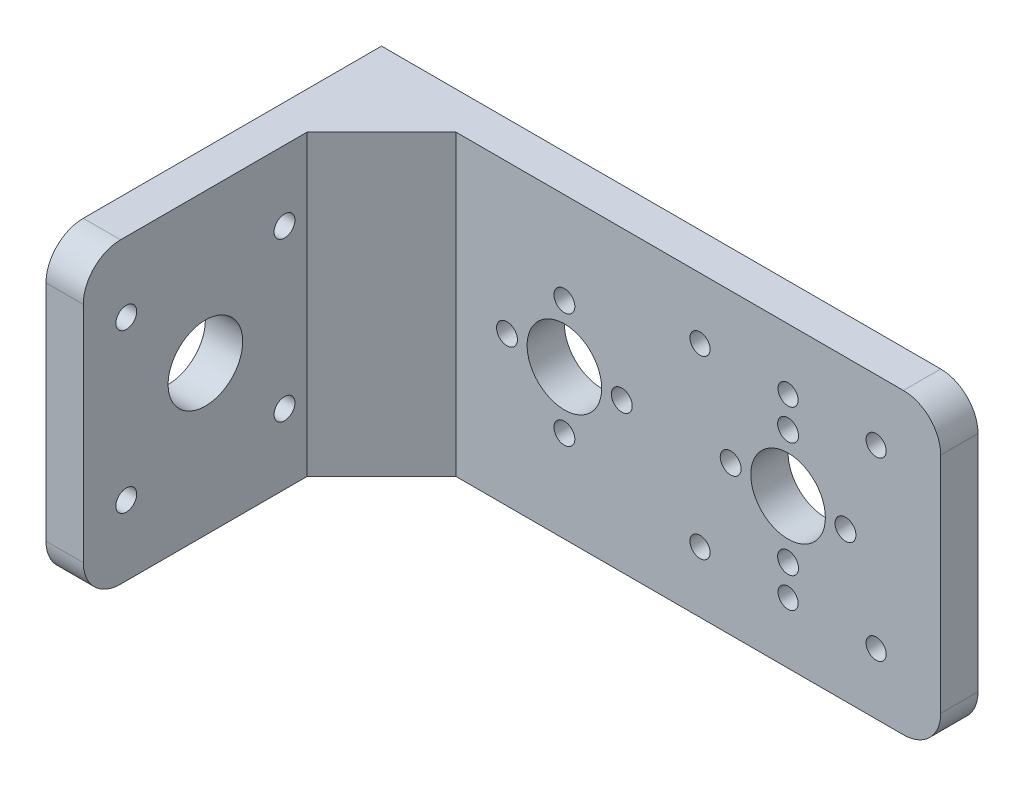
ISO-10303-21;
HEADER;
FILE_DESCRIPTION(('STEP AP214'),'2;1');
FILE_NAME('part.step','',(''),(''),'','','');
FILE_SCHEMA(('AUTOMOTIVE_DESIGN { 1 0 10303 214 1 1 1 1 }'));
ENDSEC;
DATA;
#1=APPLICATION_CONTEXT('core data for automotive mechanical design processes');
#2=APPLICATION_PROTOCOL_DEFINITION('international standard','automotive_design',2000,#1);
#3=PRODUCT_CONTEXT('',#1,'mechanical');
#4=PRODUCT('Part','Part','',(#3));
#5=PRODUCT_RELATED_PRODUCT_CATEGORY('part','',(#4));
#6=PRODUCT_DEFINITION_FORMATION('','',#4);
#7=PRODUCT_DEFINITION_CONTEXT('part definition',#1,'design');
#8=PRODUCT_DEFINITION('design','',#6,#7);
#9=PRODUCT_DEFINITION_SHAPE('','',#8);
#10=(LENGTH_UNIT() NAMED_UNIT(*) SI_UNIT(.MILLI.,.METRE.));
#11=(NAMED_UNIT(*) PLANE_ANGLE_UNIT() SI_UNIT($,.RADIAN.));
#12=(NAMED_UNIT(*) SI_UNIT($,.STERADIAN.) SOLID_ANGLE_UNIT());
#13=UNCERTAINTY_MEASURE_WITH_UNIT(LENGTH_MEASURE(1.E-05),#10,'distance_accuracy_value','');
#14=(GEOMETRIC_REPRESENTATION_CONTEXT(3) GLOBAL_UNCERTAINTY_ASSIGNED_CONTEXT((#13)) GLOBAL_UNIT_ASSIGNED_CONTEXT((#10,
#11,#12)) REPRESENTATION_CONTEXT('',''));
#15=CARTESIAN_POINT('',(0.,0.,0.));
#16=DIRECTION('',(0.,0.,1.));
#17=DIRECTION('',(1.,0.,0.));
#18=AXIS2_PLACEMENT_3D('',#15,#16,#17);
#19=CARTESIAN_POINT('',(0.,0.,6.35));
#20=DIRECTION('',(0.,0.,-1.));
#21=DIRECTION('',(-1.,0.,0.));
#22=AXIS2_PLACEMENT_3D('',#19,#20,#21);
#23=PLANE('',#22);
#24=CARTESIAN_POINT('',(-64.1,-15.621,6.35));
#25=DIRECTION('',(0.,0.,1.));
#26=DIRECTION('',(1.,0.,0.));
#27=AXIS2_PLACEMENT_3D('',#24,#25,#26);
#28=CIRCLE('',#27,1.778);
#29=CARTESIAN_POINT('',(-62.322,-15.621,6.35));
#30=VERTEX_POINT('',#29);
#31=EDGE_CURVE('E304',#30,#30,#28,.T.);
#32=ORIENTED_EDGE('',*,*,#31,.F.);
#33=EDGE_LOOP('',(#32));
#34=FACE_BOUND('',#33,.T.);
#35=CARTESIAN_POINT('',(-73.879,-25.4,6.35));
#36=DIRECTION('',(0.,0.,1.));
#37=DIRECTION('',(0.,1.,0.));
#38=AXIS2_PLACEMENT_3D('',#35,#36,#37);
#39=CIRCLE('',#38,1.778);
#40=CARTESIAN_POINT('',(-73.879,-23.622,6.35));
#41=VERTEX_POINT('',#40);
#42=EDGE_CURVE('E310',#41,#41,#39,.T.);
#43=ORIENTED_EDGE('',*,*,#42,.F.);
#44=EDGE_LOOP('',(#43));
#45=FACE_BOUND('',#44,.T.);
#46=CARTESIAN_POINT('',(-64.1,-35.179,6.35));
#47=DIRECTION('',(0.,0.,1.));
#48=DIRECTION('',(-1.,0.,0.));
#49=AXIS2_PLACEMENT_3D('',#46,#47,#48);
#50=CIRCLE('',#49,1.778);
#51=CARTESIAN_POINT('',(-65.878,-35.179,6.35));
#52=VERTEX_POINT('',#51);
#53=EDGE_CURVE('E316',#52,#52,#50,.T.);
#54=ORIENTED_EDGE('',*,*,#53,.F.);
#55=EDGE_LOOP('',(#54));
#56=FACE_BOUND('',#55,.T.);
#57=CARTESIAN_POINT('',(-54.321,-25.3999999999999,6.35));
#58=DIRECTION('',(0.,0.,1.));
#59=DIRECTION('',(0.,-1.,0.));
#60=AXIS2_PLACEMENT_3D('',#57,#58,#59);
#61=CIRCLE('',#60,1.778);
#62=CARTESIAN_POINT('',(-54.321,-27.1779999999999,6.35));
#63=VERTEX_POINT('',#62);
#64=EDGE_CURVE('E298',#63,#63,#61,.T.);
#65=ORIENTED_EDGE('',*,*,#64,.F.);
#66=EDGE_LOOP('',(#65));
#67=FACE_BOUND('',#66,.T.);
#68=CARTESIAN_POINT('',(-64.1,-25.4,6.35));
#69=DIRECTION('',(0.,0.,1.));
#70=DIRECTION('',(1.,0.,0.));
#71=AXIS2_PLACEMENT_3D('',#68,#69,#70);
#72=CIRCLE('',#71,6.35);
#73=CARTESIAN_POINT('',(-57.75,-25.4,6.35));
#74=VERTEX_POINT('',#73);
#75=EDGE_CURVE('E303',#74,#74,#72,.T.);
#76=ORIENTED_EDGE('',*,*,#75,.F.);
#77=EDGE_LOOP('',(#76));
#78=FACE_BOUND('',#77,.T.);
#79=CARTESIAN_POINT('',(-11.,-10.400000028,6.35));
#80=DIRECTION('',(0.,0.,1.));
#81=DIRECTION('',(1.,0.,0.));
#82=AXIS2_PLACEMENT_3D('',#79,#80,#81);
#83=CIRCLE('',#82,1.7145);
#84=CARTESIAN_POINT('',(-9.2855,-10.400000028,6.35));
#85=VERTEX_POINT('',#84);
#86=EDGE_CURVE('E246',#85,#85,#83,.T.);
#87=ORIENTED_EDGE('',*,*,#86,.F.);
#88=EDGE_LOOP('',(#87));
#89=FACE_BOUND('',#88,.T.);
#90=CARTESIAN_POINT('',(-25.999999972,-10.400000028,6.35));
#91=DIRECTION('',(0.,0.,1.));
#92=DIRECTION('',(1.,0.,0.));
#93=AXIS2_PLACEMENT_3D('',#90,#91,#92);
#94=CIRCLE('',#93,1.7145);
#95=CARTESIAN_POINT('',(-24.285499972,-10.400000028,6.35));
#96=VERTEX_POINT('',#95);
#97=EDGE_CURVE('E234',#96,#96,#94,.T.);
#98=ORIENTED_EDGE('',*,*,#97,.F.);
#99=EDGE_LOOP('',(#98));
#100=FACE_BOUND('',#99,.T.);
#101=CARTESIAN_POINT('',(-25.999999972,-40.399999972,6.35));
#102=DIRECTION('',(0.,0.,1.));
#103=DIRECTION('',(1.,0.,0.));
#104=AXIS2_PLACEMENT_3D('',#101,#102,#103);
#105=CIRCLE('',#104,1.7145);
#106=CARTESIAN_POINT('',(-24.285499972,-40.399999972,6.35));
#107=VERTEX_POINT('',#106);
#108=EDGE_CURVE('E240',#107,#107,#105,.T.);
#109=ORIENTED_EDGE('',*,*,#108,.F.);
#110=EDGE_LOOP('',(#109));
#111=FACE_BOUND('',#110,.T.);
#112=CARTESIAN_POINT('',(-11.,-40.399999972,6.35));
#113=DIRECTION('',(0.,0.,1.));
#114=DIRECTION('',(1.,0.,0.));
#115=AXIS2_PLACEMENT_3D('',#112,#113,#114);
#116=CIRCLE('',#115,1.7145);
#117=CARTESIAN_POINT('',(-9.2855,-40.399999972,6.35));
#118=VERTEX_POINT('',#117);
#119=EDGE_CURVE('E259',#118,#118,#116,.T.);
#120=ORIENTED_EDGE('',*,*,#119,.F.);
#121=EDGE_LOOP('',(#120));
#122=FACE_BOUND('',#121,.T.);
#123=CARTESIAN_POINT('',(-41.,-40.399999972,6.35));
#124=DIRECTION('',(0.,0.,1.));
#125=DIRECTION('',(1.,0.,0.));
#126=AXIS2_PLACEMENT_3D('',#123,#124,#125);
#127=CIRCLE('',#126,1.7145);
#128=CARTESIAN_POINT('',(-39.2855,-40.399999972,6.35));
#129=VERTEX_POINT('',#128);
#130=EDGE_CURVE('E253',#129,#129,#127,.T.);
#131=ORIENTED_EDGE('',*,*,#130,.F.);
#132=EDGE_LOOP('',(#131));
#133=FACE_BOUND('',#132,.T.);
#134=CARTESIAN_POINT('',(-41.,-10.400000028,6.35));
#135=DIRECTION('',(0.,0.,1.));
#136=DIRECTION('',(1.,0.,0.));
#137=AXIS2_PLACEMENT_3D('',#134,#135,#136);
#138=CIRCLE('',#137,1.7145);
#139=CARTESIAN_POINT('',(-39.2855,-10.400000028,6.35));
#140=VERTEX_POINT('',#139);
#141=EDGE_CURVE('E247',#140,#140,#138,.T.);
#142=ORIENTED_EDGE('',*,*,#141,.F.);
#143=EDGE_LOOP('',(#142));
#144=FACE_BOUND('',#143,.T.);
#145=CARTESIAN_POINT('',(-26.,-15.621,6.35));
#146=DIRECTION('',(0.,0.,1.));
#147=DIRECTION('',(1.,0.,0.));
#148=AXIS2_PLACEMENT_3D('',#145,#146,#147);
#149=CIRCLE('',#148,1.778);
#150=CARTESIAN_POINT('',(-24.222,-15.621,6.35));
#151=VERTEX_POINT('',#150);
#152=EDGE_CURVE('E228',#151,#151,#149,.T.);
#153=ORIENTED_EDGE('',*,*,#152,.F.);
#154=EDGE_LOOP('',(#153));
#155=FACE_BOUND('',#154,.T.);
#156=CARTESIAN_POINT('',(-26.,-25.4,6.35));
#157=DIRECTION('',(0.,0.,1.));
#158=DIRECTION('',(1.,0.,0.));
#159=AXIS2_PLACEMENT_3D('',#156,#157,#158);
#160=CIRCLE('',#159,6.35);
#161=CARTESIAN_POINT('',(-19.65,-25.4,6.35));
#162=VERTEX_POINT('',#161);
#163=EDGE_CURVE('E210',#162,#162,#160,.T.);
#164=ORIENTED_EDGE('',*,*,#163,.F.);
#165=EDGE_LOOP('',(#164));
#166=FACE_BOUND('',#165,.T.);
#167=CARTESIAN_POINT('',(-16.221,-25.3999999999999,6.35));
#168=DIRECTION('',(0.,0.,1.));
#169=DIRECTION('',(0.,-1.,0.));
#170=AXIS2_PLACEMENT_3D('',#167,#168,#169);
#171=CIRCLE('',#170,1.778);
#172=CARTESIAN_POINT('',(-16.221,-27.1779999999999,6.35));
#173=VERTEX_POINT('',#172);
#174=EDGE_CURVE('E189',#173,#173,#171,.T.);
#175=ORIENTED_EDGE('',*,*,#174,.F.);
#176=EDGE_LOOP('',(#175));
#177=FACE_BOUND('',#176,.T.);
#178=CARTESIAN_POINT('',(-26.,-35.179,6.35));
#179=DIRECTION('',(0.,0.,1.));
#180=DIRECTION('',(-1.,0.,0.));
#181=AXIS2_PLACEMENT_3D('',#178,#179,#180);
#182=CIRCLE('',#181,1.778);
#183=CARTESIAN_POINT('',(-27.778,-35.179,6.35));
#184=VERTEX_POINT('',#183);
#185=EDGE_CURVE('E217',#184,#184,#182,.T.);
#186=ORIENTED_EDGE('',*,*,#185,.F.);
#187=EDGE_LOOP('',(#186));
#188=FACE_BOUND('',#187,.T.);
#189=CARTESIAN_POINT('',(-35.779,-25.4,6.35));
#190=DIRECTION('',(0.,0.,1.));
#191=DIRECTION('',(0.,1.,0.));
#192=AXIS2_PLACEMENT_3D('',#189,#190,#191);
#193=CIRCLE('',#192,1.778);
#194=CARTESIAN_POINT('',(-35.779,-23.622,6.35));
#195=VERTEX_POINT('',#194);
#196=EDGE_CURVE('E211',#195,#195,#193,.T.);
#197=ORIENTED_EDGE('',*,*,#196,.F.);
#198=EDGE_LOOP('',(#197));
#199=FACE_BOUND('',#198,.T.);
#200=DIRECTION('',(1.,0.,0.));
#201=VECTOR('',#200,1.);
#202=CARTESIAN_POINT('',(0.,-50.8,6.35));
#203=LINE('',#202,#201);
#204=CARTESIAN_POINT('',(-82.55,-50.8,6.35));
#205=VERTEX_POINT('',#204);
#206=CARTESIAN_POINT('',(-6.35,-50.8,6.35));
#207=VERTEX_POINT('',#206);
#208=EDGE_CURVE('E149',#205,#207,#203,.T.);
#209=ORIENTED_EDGE('',*,*,#208,.T.);
#210=CARTESIAN_POINT('',(-6.35,-44.45,6.35));
#211=DIRECTION('',(0.,0.,-1.));
#212=DIRECTION('',(-1.,0.,0.));
#213=AXIS2_PLACEMENT_3D('',#210,#211,#212);
#214=CIRCLE('',#213,6.35);
#215=CARTESIAN_POINT('',(0.,-44.45,6.35));
#216=VERTEX_POINT('',#215);
#217=EDGE_CURVE('E165',#207,#216,#214,.F.);
#218=ORIENTED_EDGE('',*,*,#217,.T.);
#219=DIRECTION('',(0.,1.,0.));
#220=VECTOR('',#219,1.);
#221=CARTESIAN_POINT('',(0.,0.,6.35));
#222=LINE('',#221,#220);
#223=CARTESIAN_POINT('',(0.,-6.35,6.35));
#224=VERTEX_POINT('',#223);
#225=EDGE_CURVE('E145',#216,#224,#222,.T.);
#226=ORIENTED_EDGE('',*,*,#225,.T.);
#227=CARTESIAN_POINT('',(-6.35,-6.35,6.35));
#228=DIRECTION('',(0.,0.,-1.));
#229=DIRECTION('',(-1.,0.,0.));
#230=AXIS2_PLACEMENT_3D('',#227,#228,#229);
#231=CIRCLE('',#230,6.35);
#232=CARTESIAN_POINT('',(-6.35,0.,6.35));
#233=VERTEX_POINT('',#232);
#234=EDGE_CURVE('E163',#224,#233,#231,.F.);
#235=ORIENTED_EDGE('',*,*,#234,.T.);
#236=DIRECTION('',(-1.,0.,0.));
#237=VECTOR('',#236,1.);
#238=CARTESIAN_POINT('',(0.,0.,6.35));
#239=LINE('',#238,#237);
#240=CARTESIAN_POINT('',(-82.55,0.,6.35));
#241=VERTEX_POINT('',#240);
#242=EDGE_CURVE('E274',#233,#241,#239,.T.);
#243=ORIENTED_EDGE('',*,*,#242,.T.);
#244=DIRECTION('',(0.,-1.,0.));
#245=VECTOR('',#244,1.);
#246=CARTESIAN_POINT('',(-82.55,0.,6.35));
#247=LINE('',#246,#245);
#248=EDGE_CURVE('E292',#241,#205,#247,.T.);
#249=ORIENTED_EDGE('',*,*,#248,.T.);
#250=EDGE_LOOP('',(#209,#218,#226,#235,#243,#249));
#251=FACE_BOUND('',#250,.T.);
#252=ADVANCED_FACE('F33',(#34,#45,#56,#67,#78,#89,#100,#111,#122,#133,#144,#155,#166,#177,#188,
#199,#251),#23,.F.);
#253=CARTESIAN_POINT('',(0.,0.,6.35));
#254=DIRECTION('',(-1.,0.,0.));
#255=DIRECTION('',(0.,0.,1.));
#256=AXIS2_PLACEMENT_3D('',#253,#254,#255);
#257=PLANE('',#256);
#258=ORIENTED_EDGE('',*,*,#225,.F.);
#259=DIRECTION('',(0.,0.,-1.));
#260=VECTOR('',#259,1.);
#261=CARTESIAN_POINT('',(0.,-44.45,6.35));
#262=LINE('',#261,#260);
#263=CARTESIAN_POINT('',(0.,-44.45,0.));
#264=VERTEX_POINT('',#263);
#265=EDGE_CURVE('E152',#216,#264,#262,.T.);
#266=ORIENTED_EDGE('',*,*,#265,.T.);
#267=DIRECTION('',(0.,1.,0.));
#268=VECTOR('',#267,1.);
#269=CARTESIAN_POINT('',(0.,0.,0.));
#270=LINE('',#269,#268);
#271=CARTESIAN_POINT('',(0.,-6.35,0.));
#272=VERTEX_POINT('',#271);
#273=EDGE_CURVE('E138',#264,#272,#270,.T.);
#274=ORIENTED_EDGE('',*,*,#273,.T.);
#275=DIRECTION('',(0.,0.,-1.));
#276=VECTOR('',#275,1.);
#277=CARTESIAN_POINT('',(0.,-6.35,6.35));
#278=LINE('',#277,#276);
#279=EDGE_CURVE('E127',#272,#224,#278,.F.);
#280=ORIENTED_EDGE('',*,*,#279,.T.);
#281=EDGE_LOOP('',(#258,#266,#274,#280));
#282=FACE_BOUND('',#281,.T.);
#283=ADVANCED_FACE('F281',(#282),#257,.F.);
#284=CARTESIAN_POINT('',(0.,0.,6.35));
#285=DIRECTION('',(0.,-1.,0.));
#286=DIRECTION('',(1.,0.,0.));
#287=AXIS2_PLACEMENT_3D('',#284,#285,#286);
#288=PLANE('',#287);
#289=ORIENTED_EDGE('',*,*,#242,.F.);
#290=DIRECTION('',(0.,0.,-1.));
#291=VECTOR('',#290,1.);
#292=CARTESIAN_POINT('',(-6.35,0.,6.35));
#293=LINE('',#292,#291);
#294=CARTESIAN_POINT('',(-6.35,0.,0.));
#295=VERTEX_POINT('',#294);
#296=EDGE_CURVE('E136',#233,#295,#293,.T.);
#297=ORIENTED_EDGE('',*,*,#296,.T.);
#298=DIRECTION('',(-1.,0.,0.));
#299=VECTOR('',#298,1.);
#300=CARTESIAN_POINT('',(0.,0.,0.));
#301=LINE('',#300,#299);
#302=CARTESIAN_POINT('',(-101.6,0.,0.));
#303=VERTEX_POINT('',#302);
#304=EDGE_CURVE('E132',#295,#303,#301,.T.);
#305=ORIENTED_EDGE('',*,*,#304,.T.);
#306=DIRECTION('',(0.,0.,-1.));
#307=VECTOR('',#306,1.);
#308=CARTESIAN_POINT('',(-101.6,0.,6.35));
#309=LINE('',#308,#307);
#310=CARTESIAN_POINT('',(-101.6,0.,50.8));
#311=VERTEX_POINT('',#310);
#312=EDGE_CURVE('E116',#311,#303,#309,.T.);
#313=ORIENTED_EDGE('',*,*,#312,.F.);
#314=DIRECTION('',(-1.,0.,0.));
#315=VECTOR('',#314,1.);
#316=CARTESIAN_POINT('',(-95.25,0.,50.8));
#317=LINE('',#316,#315);
#318=CARTESIAN_POINT('',(-95.25,0.,50.8));
#319=VERTEX_POINT('',#318);
#320=EDGE_CURVE('E167',#311,#319,#317,.F.);
#321=ORIENTED_EDGE('',*,*,#320,.T.);
#322=DIRECTION('',(0.,0.,-1.));
#323=VECTOR('',#322,1.);
#324=CARTESIAN_POINT('',(-95.25,0.,57.15));
#325=LINE('',#324,#323);
#326=CARTESIAN_POINT('',(-95.25,0.,19.05));
#327=VERTEX_POINT('',#326);
#328=EDGE_CURVE('E190',#319,#327,#325,.T.);
#329=ORIENTED_EDGE('',*,*,#328,.T.);
#330=DIRECTION('',(-0.707106781186547,0.,0.707106781186548));
#331=VECTOR('',#330,1.);
#332=CARTESIAN_POINT('',(-95.25,0.,19.05));
#333=LINE('',#332,#331);
#334=EDGE_CURVE('E290',#241,#327,#333,.T.);
#335=ORIENTED_EDGE('',*,*,#334,.F.);
#336=EDGE_LOOP('',(#289,#297,#305,#313,#321,#329,#335));
#337=FACE_BOUND('',#336,.T.);
#338=ADVANCED_FACE('F134',(#337),#288,.F.);
#339=CARTESIAN_POINT('',(-101.6,0.,6.35));
#340=DIRECTION('',(1.,0.,0.));
#341=DIRECTION('',(0.,0.,-1.));
#342=AXIS2_PLACEMENT_3D('',#339,#340,#341);
#343=PLANE('',#342);
#344=CARTESIAN_POINT('',(-101.6,-38.8747000000001,49.8247));
#345=DIRECTION('',(1.,0.,0.));
#346=DIRECTION('',(0.,1.,0.));
#347=AXIS2_PLACEMENT_3D('',#344,#345,#346);
#348=CIRCLE('',#347,1.778);
#349=CARTESIAN_POINT('',(-101.6,-37.0967000000001,49.8247));
#350=VERTEX_POINT('',#349);
#351=EDGE_CURVE('E330',#350,#350,#348,.T.);
#352=ORIENTED_EDGE('',*,*,#351,.T.);
#353=EDGE_LOOP('',(#352));
#354=FACE_BOUND('',#353,.T.);
#355=CARTESIAN_POINT('',(-101.6,-38.8747,22.8753));
#356=DIRECTION('',(1.,0.,0.));
#357=DIRECTION('',(0.,0.,1.));
#358=AXIS2_PLACEMENT_3D('',#355,#356,#357);
#359=CIRCLE('',#358,1.778);
#360=CARTESIAN_POINT('',(-101.6,-38.8747,24.6533));
#361=VERTEX_POINT('',#360);
#362=EDGE_CURVE('E337',#361,#361,#359,.T.);
#363=ORIENTED_EDGE('',*,*,#362,.T.);
#364=EDGE_LOOP('',(#363));
#365=FACE_BOUND('',#364,.T.);
#366=CARTESIAN_POINT('',(-101.6,-11.9252999999999,22.8753000000001));
#367=DIRECTION('',(1.,0.,0.));
#368=DIRECTION('',(0.,-1.,0.));
#369=AXIS2_PLACEMENT_3D('',#366,#367,#368);
#370=CIRCLE('',#369,1.778);
#371=CARTESIAN_POINT('',(-101.6,-13.7032999999999,22.8753000000001));
#372=VERTEX_POINT('',#371);
#373=EDGE_CURVE('E343',#372,#372,#370,.T.);
#374=ORIENTED_EDGE('',*,*,#373,.T.);
#375=EDGE_LOOP('',(#374));
#376=FACE_BOUND('',#375,.T.);
#377=CARTESIAN_POINT('',(-101.6,-11.9253,49.8247));
#378=DIRECTION('',(1.,0.,0.));
#379=DIRECTION('',(0.,0.,-1.));
#380=AXIS2_PLACEMENT_3D('',#377,#378,#379);
#381=CIRCLE('',#380,1.778);
#382=CARTESIAN_POINT('',(-101.6,-11.9253,48.0467));
#383=VERTEX_POINT('',#382);
#384=EDGE_CURVE('E348',#383,#383,#381,.T.);
#385=ORIENTED_EDGE('',*,*,#384,.T.);
#386=EDGE_LOOP('',(#385));
#387=FACE_BOUND('',#386,.T.);
#388=CARTESIAN_POINT('',(-101.6,-25.4,36.35));
#389=DIRECTION('',(1.,0.,0.));
#390=DIRECTION('',(0.,0.,-1.));
#391=AXIS2_PLACEMENT_3D('',#388,#389,#390);
#392=CIRCLE('',#391,6.35);
#393=CARTESIAN_POINT('',(-101.6,-25.4,30.));
#394=VERTEX_POINT('',#393);
#395=EDGE_CURVE('E198',#394,#394,#392,.T.);
#396=ORIENTED_EDGE('',*,*,#395,.T.);
#397=EDGE_LOOP('',(#396));
#398=FACE_BOUND('',#397,.T.);
#399=DIRECTION('',(0.,-1.,0.));
#400=VECTOR('',#399,1.);
#401=CARTESIAN_POINT('',(-101.6,0.,57.15));
#402=LINE('',#401,#400);
#403=CARTESIAN_POINT('',(-101.6,-6.35000000000001,57.15));
#404=VERTEX_POINT('',#403);
#405=CARTESIAN_POINT('',(-101.6,-44.45,57.15));
#406=VERTEX_POINT('',#405);
#407=EDGE_CURVE('E194',#404,#406,#402,.T.);
#408=ORIENTED_EDGE('',*,*,#407,.F.);
#409=CARTESIAN_POINT('',(-101.6,-6.35000000000001,50.8));
#410=DIRECTION('',(1.,0.,0.));
#411=DIRECTION('',(0.,0.,-1.));
#412=AXIS2_PLACEMENT_3D('',#409,#410,#411);
#413=CIRCLE('',#412,6.35);
#414=EDGE_CURVE('E124',#404,#311,#413,.F.);
#415=ORIENTED_EDGE('',*,*,#414,.T.);
#416=ORIENTED_EDGE('',*,*,#312,.T.);
#417=DIRECTION('',(0.,-1.,0.));
#418=VECTOR('',#417,1.);
#419=CARTESIAN_POINT('',(-101.6,0.,0.));
#420=LINE('',#419,#418);
#421=CARTESIAN_POINT('',(-101.6,-50.8,0.));
#422=VERTEX_POINT('',#421);
#423=EDGE_CURVE('E122',#303,#422,#420,.T.);
#424=ORIENTED_EDGE('',*,*,#423,.T.);
#425=DIRECTION('',(0.,0.,-1.));
#426=VECTOR('',#425,1.);
#427=CARTESIAN_POINT('',(-101.6,-50.8,6.35));
#428=LINE('',#427,#426);
#429=CARTESIAN_POINT('',(-101.6,-50.8,50.8));
#430=VERTEX_POINT('',#429);
#431=EDGE_CURVE('E128',#430,#422,#428,.T.);
#432=ORIENTED_EDGE('',*,*,#431,.F.);
#433=CARTESIAN_POINT('',(-101.6,-44.45,50.8));
#434=DIRECTION('',(1.,0.,0.));
#435=DIRECTION('',(0.,0.,-1.));
#436=AXIS2_PLACEMENT_3D('',#433,#434,#435);
#437=CIRCLE('',#436,6.35);
#438=EDGE_CURVE('E175',#430,#406,#437,.F.);
#439=ORIENTED_EDGE('',*,*,#438,.T.);
#440=EDGE_LOOP('',(#408,#415,#416,#424,#432,#439));
#441=FACE_BOUND('',#440,.T.);
#442=ADVANCED_FACE('F119',(#354,#365,#376,#387,#398,#441),#343,.F.);
#443=CARTESIAN_POINT('',(0.,-50.8,6.35));
#444=DIRECTION('',(0.,1.,0.));
#445=DIRECTION('',(-1.,0.,0.));
#446=AXIS2_PLACEMENT_3D('',#443,#444,#445);
#447=PLANE('',#446);
#448=DIRECTION('',(1.,0.,0.));
#449=VECTOR('',#448,1.);
#450=CARTESIAN_POINT('',(0.,-50.8,0.));
#451=LINE('',#450,#449);
#452=CARTESIAN_POINT('',(-6.35,-50.8,0.));
#453=VERTEX_POINT('',#452);
#454=EDGE_CURVE('E143',#422,#453,#451,.T.);
#455=ORIENTED_EDGE('',*,*,#454,.T.);
#456=DIRECTION('',(0.,0.,-1.));
#457=VECTOR('',#456,1.);
#458=CARTESIAN_POINT('',(-6.35,-50.8,6.35));
#459=LINE('',#458,#457);
#460=EDGE_CURVE('E161',#453,#207,#459,.F.);
#461=ORIENTED_EDGE('',*,*,#460,.T.);
#462=ORIENTED_EDGE('',*,*,#208,.F.);
#463=DIRECTION('',(-0.707106781186547,0.,0.707106781186548));
#464=VECTOR('',#463,1.);
#465=CARTESIAN_POINT('',(-95.25,-50.8,19.05));
#466=LINE('',#465,#464);
#467=CARTESIAN_POINT('',(-95.25,-50.8,19.05));
#468=VERTEX_POINT('',#467);
#469=EDGE_CURVE('E188',#205,#468,#466,.T.);
#470=ORIENTED_EDGE('',*,*,#469,.T.);
#471=DIRECTION('',(0.,0.,-1.));
#472=VECTOR('',#471,1.);
#473=CARTESIAN_POINT('',(-95.25,-50.8,57.15));
#474=LINE('',#473,#472);
#475=CARTESIAN_POINT('',(-95.25,-50.8,50.8));
#476=VERTEX_POINT('',#475);
#477=EDGE_CURVE('E180',#476,#468,#474,.T.);
#478=ORIENTED_EDGE('',*,*,#477,.F.);
#479=DIRECTION('',(1.,0.,0.));
#480=VECTOR('',#479,1.);
#481=CARTESIAN_POINT('',(-101.6,-50.8,50.8));
#482=LINE('',#481,#480);
#483=EDGE_CURVE('E159',#476,#430,#482,.F.);
#484=ORIENTED_EDGE('',*,*,#483,.T.);
#485=ORIENTED_EDGE('',*,*,#431,.T.);
#486=EDGE_LOOP('',(#455,#461,#462,#470,#478,#484,#485));
#487=FACE_BOUND('',#486,.T.);
#488=ADVANCED_FACE('F185',(#487),#447,.F.);
#489=CARTESIAN_POINT('',(0.,0.,0.));
#490=DIRECTION('',(0.,0.,-1.));
#491=DIRECTION('',(-1.,0.,0.));
#492=AXIS2_PLACEMENT_3D('',#489,#490,#491);
#493=PLANE('',#492);
#494=CARTESIAN_POINT('',(-64.1,-15.621,0.));
#495=DIRECTION('',(0.,0.,1.));
#496=DIRECTION('',(1.,0.,0.));
#497=AXIS2_PLACEMENT_3D('',#494,#495,#496);
#498=CIRCLE('',#497,1.778);
#499=CARTESIAN_POINT('',(-62.322,-15.621,0.));
#500=VERTEX_POINT('',#499);
#501=EDGE_CURVE('E300',#500,#500,#498,.T.);
#502=ORIENTED_EDGE('',*,*,#501,.T.);
#503=EDGE_LOOP('',(#502));
#504=FACE_BOUND('',#503,.T.);
#505=CARTESIAN_POINT('',(-73.879,-25.4,0.));
#506=DIRECTION('',(0.,0.,1.));
#507=DIRECTION('',(0.,1.,0.));
#508=AXIS2_PLACEMENT_3D('',#505,#506,#507);
#509=CIRCLE('',#508,1.778);
#510=CARTESIAN_POINT('',(-73.879,-23.622,0.));
#511=VERTEX_POINT('',#510);
#512=EDGE_CURVE('E307',#511,#511,#509,.T.);
#513=ORIENTED_EDGE('',*,*,#512,.T.);
#514=EDGE_LOOP('',(#513));
#515=FACE_BOUND('',#514,.T.);
#516=CARTESIAN_POINT('',(-64.1,-35.179,0.));
#517=DIRECTION('',(0.,0.,1.));
#518=DIRECTION('',(-1.,0.,0.));
#519=AXIS2_PLACEMENT_3D('',#516,#517,#518);
#520=CIRCLE('',#519,1.778);
#521=CARTESIAN_POINT('',(-65.878,-35.179,0.));
#522=VERTEX_POINT('',#521);
#523=EDGE_CURVE('E313',#522,#522,#520,.T.);
#524=ORIENTED_EDGE('',*,*,#523,.T.);
#525=EDGE_LOOP('',(#524));
#526=FACE_BOUND('',#525,.T.);
#527=CARTESIAN_POINT('',(-54.321,-25.3999999999999,0.));
#528=DIRECTION('',(0.,0.,1.));
#529=DIRECTION('',(0.,-1.,0.));
#530=AXIS2_PLACEMENT_3D('',#527,#528,#529);
#531=CIRCLE('',#530,1.778);
#532=CARTESIAN_POINT('',(-54.321,-27.1779999999999,0.));
#533=VERTEX_POINT('',#532);
#534=EDGE_CURVE('E319',#533,#533,#531,.T.);
#535=ORIENTED_EDGE('',*,*,#534,.T.);
#536=EDGE_LOOP('',(#535));
#537=FACE_BOUND('',#536,.T.);
#538=CARTESIAN_POINT('',(-64.1,-25.4,0.));
#539=DIRECTION('',(0.,0.,1.));
#540=DIRECTION('',(1.,0.,0.));
#541=AXIS2_PLACEMENT_3D('',#538,#539,#540);
#542=CIRCLE('',#541,6.35);
#543=CARTESIAN_POINT('',(-57.75,-25.4,0.));
#544=VERTEX_POINT('',#543);
#545=EDGE_CURVE('E324',#544,#544,#542,.T.);
#546=ORIENTED_EDGE('',*,*,#545,.T.);
#547=EDGE_LOOP('',(#546));
#548=FACE_BOUND('',#547,.T.);
#549=CARTESIAN_POINT('',(-35.779,-25.4,0.));
#550=DIRECTION('',(0.,0.,1.));
#551=DIRECTION('',(0.,1.,0.));
#552=AXIS2_PLACEMENT_3D('',#549,#550,#551);
#553=CIRCLE('',#552,1.778);
#554=CARTESIAN_POINT('',(-35.779,-23.622,0.));
#555=VERTEX_POINT('',#554);
#556=EDGE_CURVE('E207',#555,#555,#553,.T.);
#557=ORIENTED_EDGE('',*,*,#556,.T.);
#558=EDGE_LOOP('',(#557));
#559=FACE_BOUND('',#558,.T.);
#560=CARTESIAN_POINT('',(-26.,-35.179,0.));
#561=DIRECTION('',(0.,0.,1.));
#562=DIRECTION('',(-1.,0.,0.));
#563=AXIS2_PLACEMENT_3D('',#560,#561,#562);
#564=CIRCLE('',#563,1.778);
#565=CARTESIAN_POINT('',(-27.778,-35.179,0.));
#566=VERTEX_POINT('',#565);
#567=EDGE_CURVE('E214',#566,#566,#564,.T.);
#568=ORIENTED_EDGE('',*,*,#567,.T.);
#569=EDGE_LOOP('',(#568));
#570=FACE_BOUND('',#569,.T.);
#571=CARTESIAN_POINT('',(-16.221,-25.3999999999999,0.));
#572=DIRECTION('',(0.,0.,1.));
#573=DIRECTION('',(0.,-1.,0.));
#574=AXIS2_PLACEMENT_3D('',#571,#572,#573);
#575=CIRCLE('',#574,1.778);
#576=CARTESIAN_POINT('',(-16.221,-27.1779999999999,0.));
#577=VERTEX_POINT('',#576);
#578=EDGE_CURVE('E220',#577,#577,#575,.T.);
#579=ORIENTED_EDGE('',*,*,#578,.T.);
#580=EDGE_LOOP('',(#579));
#581=FACE_BOUND('',#580,.T.);
#582=CARTESIAN_POINT('',(-26.,-25.4,0.));
#583=DIRECTION('',(0.,0.,1.));
#584=DIRECTION('',(1.,0.,0.));
#585=AXIS2_PLACEMENT_3D('',#582,#583,#584);
#586=CIRCLE('',#585,6.35);
#587=CARTESIAN_POINT('',(-19.65,-25.4,0.));
#588=VERTEX_POINT('',#587);
#589=EDGE_CURVE('E225',#588,#588,#586,.T.);
#590=ORIENTED_EDGE('',*,*,#589,.T.);
#591=EDGE_LOOP('',(#590));
#592=FACE_BOUND('',#591,.T.);
#593=CARTESIAN_POINT('',(-26.,-15.621,0.));
#594=DIRECTION('',(0.,0.,1.));
#595=DIRECTION('',(1.,0.,0.));
#596=AXIS2_PLACEMENT_3D('',#593,#594,#595);
#597=CIRCLE('',#596,1.778);
#598=CARTESIAN_POINT('',(-24.222,-15.621,0.));
#599=VERTEX_POINT('',#598);
#600=EDGE_CURVE('E231',#599,#599,#597,.T.);
#601=ORIENTED_EDGE('',*,*,#600,.T.);
#602=EDGE_LOOP('',(#601));
#603=FACE_BOUND('',#602,.T.);
#604=CARTESIAN_POINT('',(-41.,-10.400000028,0.));
#605=DIRECTION('',(0.,0.,1.));
#606=DIRECTION('',(1.,0.,0.));
#607=AXIS2_PLACEMENT_3D('',#604,#605,#606);
#608=CIRCLE('',#607,1.7145);
#609=CARTESIAN_POINT('',(-39.2855,-10.400000028,0.));
#610=VERTEX_POINT('',#609);
#611=EDGE_CURVE('E243',#610,#610,#608,.T.);
#612=ORIENTED_EDGE('',*,*,#611,.T.);
#613=EDGE_LOOP('',(#612));
#614=FACE_BOUND('',#613,.T.);
#615=CARTESIAN_POINT('',(-41.,-40.399999972,0.));
#616=DIRECTION('',(0.,0.,1.));
#617=DIRECTION('',(1.,0.,0.));
#618=AXIS2_PLACEMENT_3D('',#615,#616,#617);
#619=CIRCLE('',#618,1.7145);
#620=CARTESIAN_POINT('',(-39.2855,-40.399999972,0.));
#621=VERTEX_POINT('',#620);
#622=EDGE_CURVE('E250',#621,#621,#619,.T.);
#623=ORIENTED_EDGE('',*,*,#622,.T.);
#624=EDGE_LOOP('',(#623));
#625=FACE_BOUND('',#624,.T.);
#626=CARTESIAN_POINT('',(-11.,-40.399999972,0.));
#627=DIRECTION('',(0.,0.,1.));
#628=DIRECTION('',(1.,0.,0.));
#629=AXIS2_PLACEMENT_3D('',#626,#627,#628);
#630=CIRCLE('',#629,1.7145);
#631=CARTESIAN_POINT('',(-9.2855,-40.399999972,0.));
#632=VERTEX_POINT('',#631);
#633=EDGE_CURVE('E256',#632,#632,#630,.T.);
#634=ORIENTED_EDGE('',*,*,#633,.T.);
#635=EDGE_LOOP('',(#634));
#636=FACE_BOUND('',#635,.T.);
#637=CARTESIAN_POINT('',(-25.999999972,-40.399999972,0.));
#638=DIRECTION('',(0.,0.,1.));
#639=DIRECTION('',(1.,0.,0.));
#640=AXIS2_PLACEMENT_3D('',#637,#638,#639);
#641=CIRCLE('',#640,1.7145);
#642=CARTESIAN_POINT('',(-24.285499972,-40.399999972,0.));
#643=VERTEX_POINT('',#642);
#644=EDGE_CURVE('E262',#643,#643,#641,.T.);
#645=ORIENTED_EDGE('',*,*,#644,.T.);
#646=EDGE_LOOP('',(#645));
#647=FACE_BOUND('',#646,.T.);
#648=CARTESIAN_POINT('',(-25.999999972,-10.400000028,0.));
#649=DIRECTION('',(0.,0.,1.));
#650=DIRECTION('',(1.,0.,0.));
#651=AXIS2_PLACEMENT_3D('',#648,#649,#650);
#652=CIRCLE('',#651,1.7145);
#653=CARTESIAN_POINT('',(-24.285499972,-10.400000028,0.));
#654=VERTEX_POINT('',#653);
#655=EDGE_CURVE('E237',#654,#654,#652,.T.);
#656=ORIENTED_EDGE('',*,*,#655,.T.);
#657=EDGE_LOOP('',(#656));
#658=FACE_BOUND('',#657,.T.);
#659=CARTESIAN_POINT('',(-11.,-10.400000028,0.));
#660=DIRECTION('',(0.,0.,1.));
#661=DIRECTION('',(1.,0.,0.));
#662=AXIS2_PLACEMENT_3D('',#659,#660,#661);
#663=CIRCLE('',#662,1.7145);
#664=CARTESIAN_POINT('',(-9.2855,-10.400000028,0.));
#665=VERTEX_POINT('',#664);
#666=EDGE_CURVE('E267',#665,#665,#663,.T.);
#667=ORIENTED_EDGE('',*,*,#666,.T.);
#668=EDGE_LOOP('',(#667));
#669=FACE_BOUND('',#668,.T.);
#670=ORIENTED_EDGE('',*,*,#273,.F.);
#671=CARTESIAN_POINT('',(-6.35,-44.45,0.));
#672=DIRECTION('',(0.,0.,-1.));
#673=DIRECTION('',(-1.,0.,0.));
#674=AXIS2_PLACEMENT_3D('',#671,#672,#673);
#675=CIRCLE('',#674,6.35);
#676=EDGE_CURVE('E157',#264,#453,#675,.T.);
#677=ORIENTED_EDGE('',*,*,#676,.T.);
#678=ORIENTED_EDGE('',*,*,#454,.F.);
#679=ORIENTED_EDGE('',*,*,#423,.F.);
#680=ORIENTED_EDGE('',*,*,#304,.F.);
#681=CARTESIAN_POINT('',(-6.35,-6.35,0.));
#682=DIRECTION('',(0.,0.,-1.));
#683=DIRECTION('',(-1.,0.,0.));
#684=AXIS2_PLACEMENT_3D('',#681,#682,#683);
#685=CIRCLE('',#684,6.35);
#686=EDGE_CURVE('E155',#295,#272,#685,.T.);
#687=ORIENTED_EDGE('',*,*,#686,.T.);
#688=EDGE_LOOP('',(#670,#677,#678,#679,#680,#687));
#689=FACE_BOUND('',#688,.T.);
#690=ADVANCED_FACE('F141',(#504,#515,#526,#537,#548,#559,#570,#581,#592,#603,#614,#625,#636,
#647,#658,#669,#689),#493,.T.);
#691=CARTESIAN_POINT('',(-11.,-10.400000028,0.));
#692=DIRECTION('',(0.,0.,1.));
#693=DIRECTION('',(1.,0.,0.));
#694=AXIS2_PLACEMENT_3D('',#691,#692,#693);
#695=CYLINDRICAL_SURFACE('',#694,1.7145);
#696=ORIENTED_EDGE('',*,*,#666,.F.);
#697=EDGE_LOOP('',(#696));
#698=FACE_BOUND('',#697,.T.);
#699=ORIENTED_EDGE('',*,*,#86,.T.);
#700=EDGE_LOOP('',(#699));
#701=FACE_BOUND('',#700,.T.);
#702=ADVANCED_FACE('F388',(#698,#701),#695,.F.);
#703=CARTESIAN_POINT('',(-25.999999972,-10.400000028,0.));
#704=DIRECTION('',(0.,0.,1.));
#705=DIRECTION('',(1.,0.,0.));
#706=AXIS2_PLACEMENT_3D('',#703,#704,#705);
#707=CYLINDRICAL_SURFACE('',#706,1.7145);
#708=ORIENTED_EDGE('',*,*,#655,.F.);
#709=EDGE_LOOP('',(#708));
#710=FACE_BOUND('',#709,.T.);
#711=ORIENTED_EDGE('',*,*,#97,.T.);
#712=EDGE_LOOP('',(#711));
#713=FACE_BOUND('',#712,.T.);
#714=ADVANCED_FACE('F679',(#710,#713),#707,.F.);
#715=CARTESIAN_POINT('',(-25.999999972,-40.399999972,0.));
#716=DIRECTION('',(0.,0.,1.));
#717=DIRECTION('',(1.,0.,0.));
#718=AXIS2_PLACEMENT_3D('',#715,#716,#717);
#719=CYLINDRICAL_SURFACE('',#718,1.7145);
#720=ORIENTED_EDGE('',*,*,#644,.F.);
#721=EDGE_LOOP('',(#720));
#722=FACE_BOUND('',#721,.T.);
#723=ORIENTED_EDGE('',*,*,#108,.T.);
#724=EDGE_LOOP('',(#723));
#725=FACE_BOUND('',#724,.T.);
#726=ADVANCED_FACE('F669',(#722,#725),#719,.F.);
#727=CARTESIAN_POINT('',(-11.,-40.399999972,0.));
#728=DIRECTION('',(0.,0.,1.));
#729=DIRECTION('',(1.,0.,0.));
#730=AXIS2_PLACEMENT_3D('',#727,#728,#729);
#731=CYLINDRICAL_SURFACE('',#730,1.7145);
#732=ORIENTED_EDGE('',*,*,#633,.F.);
#733=EDGE_LOOP('',(#732));
#734=FACE_BOUND('',#733,.T.);
#735=ORIENTED_EDGE('',*,*,#119,.T.);
#736=EDGE_LOOP('',(#735));
#737=FACE_BOUND('',#736,.T.);
#738=ADVANCED_FACE('F659',(#734,#737),#731,.F.);
#739=CARTESIAN_POINT('',(-41.,-40.399999972,0.));
#740=DIRECTION('',(0.,0.,1.));
#741=DIRECTION('',(1.,0.,0.));
#742=AXIS2_PLACEMENT_3D('',#739,#740,#741);
#743=CYLINDRICAL_SURFACE('',#742,1.7145);
#744=ORIENTED_EDGE('',*,*,#622,.F.);
#745=EDGE_LOOP('',(#744));
#746=FACE_BOUND('',#745,.T.);
#747=ORIENTED_EDGE('',*,*,#130,.T.);
#748=EDGE_LOOP('',(#747));
#749=FACE_BOUND('',#748,.T.);
#750=ADVANCED_FACE('F649',(#746,#749),#743,.F.);
#751=CARTESIAN_POINT('',(-41.,-10.400000028,0.));
#752=DIRECTION('',(0.,0.,1.));
#753=DIRECTION('',(1.,0.,0.));
#754=AXIS2_PLACEMENT_3D('',#751,#752,#753);
#755=CYLINDRICAL_SURFACE('',#754,1.7145);
#756=ORIENTED_EDGE('',*,*,#611,.F.);
#757=EDGE_LOOP('',(#756));
#758=FACE_BOUND('',#757,.T.);
#759=ORIENTED_EDGE('',*,*,#141,.T.);
#760=EDGE_LOOP('',(#759));
#761=FACE_BOUND('',#760,.T.);
#762=ADVANCED_FACE('F639',(#758,#761),#755,.F.);
#763=CARTESIAN_POINT('',(-26.,-15.621,0.));
#764=DIRECTION('',(0.,0.,1.));
#765=DIRECTION('',(1.,0.,0.));
#766=AXIS2_PLACEMENT_3D('',#763,#764,#765);
#767=CYLINDRICAL_SURFACE('',#766,1.778);
#768=ORIENTED_EDGE('',*,*,#600,.F.);
#769=EDGE_LOOP('',(#768));
#770=FACE_BOUND('',#769,.T.);
#771=ORIENTED_EDGE('',*,*,#152,.T.);
#772=EDGE_LOOP('',(#771));
#773=FACE_BOUND('',#772,.T.);
#774=ADVANCED_FACE('F629',(#770,#773),#767,.F.);
#775=CARTESIAN_POINT('',(-26.,-25.4,0.));
#776=DIRECTION('',(0.,0.,1.));
#777=DIRECTION('',(1.,0.,0.));
#778=AXIS2_PLACEMENT_3D('',#775,#776,#777);
#779=CYLINDRICAL_SURFACE('',#778,6.35);
#780=ORIENTED_EDGE('',*,*,#589,.F.);
#781=EDGE_LOOP('',(#780));
#782=FACE_BOUND('',#781,.T.);
#783=ORIENTED_EDGE('',*,*,#163,.T.);
#784=EDGE_LOOP('',(#783));
#785=FACE_BOUND('',#784,.T.);
#786=ADVANCED_FACE('F619',(#782,#785),#779,.F.);
#787=CARTESIAN_POINT('',(-16.221,-25.3999999999999,0.));
#788=DIRECTION('',(0.,0.,1.));
#789=DIRECTION('',(1.,0.,0.));
#790=AXIS2_PLACEMENT_3D('',#787,#788,#789);
#791=CYLINDRICAL_SURFACE('',#790,1.778);
#792=ORIENTED_EDGE('',*,*,#578,.F.);
#793=EDGE_LOOP('',(#792));
#794=FACE_BOUND('',#793,.T.);
#795=ORIENTED_EDGE('',*,*,#174,.T.);
#796=EDGE_LOOP('',(#795));
#797=FACE_BOUND('',#796,.T.);
#798=ADVANCED_FACE('F609',(#794,#797),#791,.F.);
#799=CARTESIAN_POINT('',(-26.,-35.179,0.));
#800=DIRECTION('',(0.,0.,1.));
#801=DIRECTION('',(1.,0.,0.));
#802=AXIS2_PLACEMENT_3D('',#799,#800,#801);
#803=CYLINDRICAL_SURFACE('',#802,1.778);
#804=ORIENTED_EDGE('',*,*,#567,.F.);
#805=EDGE_LOOP('',(#804));
#806=FACE_BOUND('',#805,.T.);
#807=ORIENTED_EDGE('',*,*,#185,.T.);
#808=EDGE_LOOP('',(#807));
#809=FACE_BOUND('',#808,.T.);
#810=ADVANCED_FACE('F599',(#806,#809),#803,.F.);
#811=CARTESIAN_POINT('',(-35.779,-25.4,0.));
#812=DIRECTION('',(0.,0.,1.));
#813=DIRECTION('',(1.,0.,0.));
#814=AXIS2_PLACEMENT_3D('',#811,#812,#813);
#815=CYLINDRICAL_SURFACE('',#814,1.778);
#816=ORIENTED_EDGE('',*,*,#556,.F.);
#817=EDGE_LOOP('',(#816));
#818=FACE_BOUND('',#817,.T.);
#819=ORIENTED_EDGE('',*,*,#196,.T.);
#820=EDGE_LOOP('',(#819));
#821=FACE_BOUND('',#820,.T.);
#822=ADVANCED_FACE('F358',(#818,#821),#815,.F.);
#823=CARTESIAN_POINT('',(-95.25,0.,57.15));
#824=DIRECTION('',(-1.,0.,0.));
#825=DIRECTION('',(0.,0.,1.));
#826=AXIS2_PLACEMENT_3D('',#823,#824,#825);
#827=PLANE('',#826);
#828=CARTESIAN_POINT('',(-95.25,-38.8747000000001,49.8247));
#829=DIRECTION('',(1.,0.,0.));
#830=DIRECTION('',(0.,1.,0.));
#831=AXIS2_PLACEMENT_3D('',#828,#829,#830);
#832=CIRCLE('',#831,1.778);
#833=CARTESIAN_POINT('',(-95.25,-37.0967000000001,49.8247));
#834=VERTEX_POINT('',#833);
#835=EDGE_CURVE('E334',#834,#834,#832,.T.);
#836=ORIENTED_EDGE('',*,*,#835,.F.);
#837=EDGE_LOOP('',(#836));
#838=FACE_BOUND('',#837,.T.);
#839=CARTESIAN_POINT('',(-95.25,-38.8747,22.8753));
#840=DIRECTION('',(1.,0.,0.));
#841=DIRECTION('',(0.,0.,1.));
#842=AXIS2_PLACEMENT_3D('',#839,#840,#841);
#843=CIRCLE('',#842,1.778);
#844=CARTESIAN_POINT('',(-95.25,-38.8747,24.6533));
#845=VERTEX_POINT('',#844);
#846=EDGE_CURVE('E340',#845,#845,#843,.T.);
#847=ORIENTED_EDGE('',*,*,#846,.F.);
#848=EDGE_LOOP('',(#847));
#849=FACE_BOUND('',#848,.T.);
#850=CARTESIAN_POINT('',(-95.25,-11.9252999999999,22.8753000000001));
#851=DIRECTION('',(1.,0.,0.));
#852=DIRECTION('',(0.,-1.,0.));
#853=AXIS2_PLACEMENT_3D('',#850,#851,#852);
#854=CIRCLE('',#853,1.778);
#855=CARTESIAN_POINT('',(-95.25,-13.7032999999999,22.8753000000001));
#856=VERTEX_POINT('',#855);
#857=EDGE_CURVE('E327',#856,#856,#854,.T.);
#858=ORIENTED_EDGE('',*,*,#857,.F.);
#859=EDGE_LOOP('',(#858));
#860=FACE_BOUND('',#859,.T.);
#861=CARTESIAN_POINT('',(-95.25,-11.9253,49.8247));
#862=DIRECTION('',(1.,0.,0.));
#863=DIRECTION('',(0.,0.,-1.));
#864=AXIS2_PLACEMENT_3D('',#861,#862,#863);
#865=CIRCLE('',#864,1.778);
#866=CARTESIAN_POINT('',(-95.25,-11.9253,48.0467));
#867=VERTEX_POINT('',#866);
#868=EDGE_CURVE('E333',#867,#867,#865,.T.);
#869=ORIENTED_EDGE('',*,*,#868,.F.);
#870=EDGE_LOOP('',(#869));
#871=FACE_BOUND('',#870,.T.);
#872=CARTESIAN_POINT('',(-95.25,-25.4,36.35));
#873=DIRECTION('',(1.,0.,0.));
#874=DIRECTION('',(0.,0.,-1.));
#875=AXIS2_PLACEMENT_3D('',#872,#873,#874);
#876=CIRCLE('',#875,6.35);
#877=CARTESIAN_POINT('',(-95.25,-25.4,30.));
#878=VERTEX_POINT('',#877);
#879=EDGE_CURVE('E202',#878,#878,#876,.T.);
#880=ORIENTED_EDGE('',*,*,#879,.F.);
#881=EDGE_LOOP('',(#880));
#882=FACE_BOUND('',#881,.T.);
#883=ORIENTED_EDGE('',*,*,#328,.F.);
#884=CARTESIAN_POINT('',(-95.25,-6.35000000000001,50.8));
#885=DIRECTION('',(-1.,0.,0.));
#886=DIRECTION('',(0.,0.,1.));
#887=AXIS2_PLACEMENT_3D('',#884,#885,#886);
#888=CIRCLE('',#887,6.35);
#889=CARTESIAN_POINT('',(-95.25,-6.35000000000001,57.15));
#890=VERTEX_POINT('',#889);
#891=EDGE_CURVE('E11',#319,#890,#888,.F.);
#892=ORIENTED_EDGE('',*,*,#891,.T.);
#893=DIRECTION('',(0.,1.,0.));
#894=VECTOR('',#893,1.);
#895=CARTESIAN_POINT('',(-95.25,0.,57.15));
#896=LINE('',#895,#894);
#897=CARTESIAN_POINT('',(-95.25,-44.45,57.15));
#898=VERTEX_POINT('',#897);
#899=EDGE_CURVE('E182',#898,#890,#896,.T.);
#900=ORIENTED_EDGE('',*,*,#899,.F.);
#901=CARTESIAN_POINT('',(-95.25,-44.45,50.8));
#902=DIRECTION('',(-1.,0.,0.));
#903=DIRECTION('',(0.,0.,1.));
#904=AXIS2_PLACEMENT_3D('',#901,#902,#903);
#905=CIRCLE('',#904,6.35);
#906=EDGE_CURVE('E41',#898,#476,#905,.F.);
#907=ORIENTED_EDGE('',*,*,#906,.T.);
#908=ORIENTED_EDGE('',*,*,#477,.T.);
#909=DIRECTION('',(0.,-1.,0.));
#910=VECTOR('',#909,1.);
#911=CARTESIAN_POINT('',(-95.25,0.,19.05));
#912=LINE('',#911,#910);
#913=EDGE_CURVE('E294',#327,#468,#912,.T.);
#914=ORIENTED_EDGE('',*,*,#913,.F.);
#915=EDGE_LOOP('',(#883,#892,#900,#907,#908,#914));
#916=FACE_BOUND('',#915,.T.);
#917=ADVANCED_FACE('F178',(#838,#849,#860,#871,#882,#916),#827,.F.);
#918=CARTESIAN_POINT('',(0.,0.,57.15));
#919=DIRECTION('',(0.,0.,1.));
#920=DIRECTION('',(1.,0.,0.));
#921=AXIS2_PLACEMENT_3D('',#918,#919,#920);
#922=PLANE('',#921);
#923=ORIENTED_EDGE('',*,*,#899,.T.);
#924=DIRECTION('',(-1.,0.,0.));
#925=VECTOR('',#924,1.);
#926=CARTESIAN_POINT('',(-101.6,-6.35000000000001,57.15));
#927=LINE('',#926,#925);
#928=EDGE_CURVE('E172',#890,#404,#927,.T.);
#929=ORIENTED_EDGE('',*,*,#928,.T.);
#930=ORIENTED_EDGE('',*,*,#407,.T.);
#931=DIRECTION('',(1.,0.,0.));
#932=VECTOR('',#931,1.);
#933=CARTESIAN_POINT('',(-95.25,-44.45,57.15));
#934=LINE('',#933,#932);
#935=EDGE_CURVE('E170',#406,#898,#934,.T.);
#936=ORIENTED_EDGE('',*,*,#935,.T.);
#937=EDGE_LOOP('',(#923,#929,#930,#936));
#938=FACE_BOUND('',#937,.T.);
#939=ADVANCED_FACE('F196',(#938),#922,.T.);
#940=CARTESIAN_POINT('',(-101.6,-25.4,36.35));
#941=DIRECTION('',(1.,0.,0.));
#942=DIRECTION('',(0.,0.,-1.));
#943=AXIS2_PLACEMENT_3D('',#940,#941,#942);
#944=CYLINDRICAL_SURFACE('',#943,6.35);
#945=ORIENTED_EDGE('',*,*,#395,.F.);
#946=EDGE_LOOP('',(#945));
#947=FACE_BOUND('',#946,.T.);
#948=ORIENTED_EDGE('',*,*,#879,.T.);
#949=EDGE_LOOP('',(#948));
#950=FACE_BOUND('',#949,.T.);
#951=ADVANCED_FACE('F364',(#947,#950),#944,.F.);
#952=CARTESIAN_POINT('',(-101.6,-11.9253,49.8247));
#953=DIRECTION('',(1.,0.,0.));
#954=DIRECTION('',(0.,0.,-1.));
#955=AXIS2_PLACEMENT_3D('',#952,#953,#954);
#956=CYLINDRICAL_SURFACE('',#955,1.778);
#957=ORIENTED_EDGE('',*,*,#384,.F.);
#958=EDGE_LOOP('',(#957));
#959=FACE_BOUND('',#958,.T.);
#960=ORIENTED_EDGE('',*,*,#868,.T.);
#961=EDGE_LOOP('',(#960));
#962=FACE_BOUND('',#961,.T.);
#963=ADVANCED_FACE('F354',(#959,#962),#956,.F.);
#964=CARTESIAN_POINT('',(-101.6,-11.9252999999999,22.8753000000001));
#965=DIRECTION('',(1.,0.,0.));
#966=DIRECTION('',(0.,0.,-1.));
#967=AXIS2_PLACEMENT_3D('',#964,#965,#966);
#968=CYLINDRICAL_SURFACE('',#967,1.778);
#969=ORIENTED_EDGE('',*,*,#373,.F.);
#970=EDGE_LOOP('',(#969));
#971=FACE_BOUND('',#970,.T.);
#972=ORIENTED_EDGE('',*,*,#857,.T.);
#973=EDGE_LOOP('',(#972));
#974=FACE_BOUND('',#973,.T.);
#975=ADVANCED_FACE('F372',(#971,#974),#968,.F.);
#976=CARTESIAN_POINT('',(-101.6,-38.8747,22.8753));
#977=DIRECTION('',(1.,0.,0.));
#978=DIRECTION('',(0.,0.,-1.));
#979=AXIS2_PLACEMENT_3D('',#976,#977,#978);
#980=CYLINDRICAL_SURFACE('',#979,1.778);
#981=ORIENTED_EDGE('',*,*,#362,.F.);
#982=EDGE_LOOP('',(#981));
#983=FACE_BOUND('',#982,.T.);
#984=ORIENTED_EDGE('',*,*,#846,.T.);
#985=EDGE_LOOP('',(#984));
#986=FACE_BOUND('',#985,.T.);
#987=ADVANCED_FACE('F442',(#983,#986),#980,.F.);
#988=CARTESIAN_POINT('',(-101.6,-38.8747000000001,49.8247));
#989=DIRECTION('',(1.,0.,0.));
#990=DIRECTION('',(0.,0.,-1.));
#991=AXIS2_PLACEMENT_3D('',#988,#989,#990);
#992=CYLINDRICAL_SURFACE('',#991,1.778);
#993=ORIENTED_EDGE('',*,*,#351,.F.);
#994=EDGE_LOOP('',(#993));
#995=FACE_BOUND('',#994,.T.);
#996=ORIENTED_EDGE('',*,*,#835,.T.);
#997=EDGE_LOOP('',(#996));
#998=FACE_BOUND('',#997,.T.);
#999=ADVANCED_FACE('F438',(#995,#998),#992,.F.);
#1000=CARTESIAN_POINT('',(-64.1,-25.4,0.));
#1001=DIRECTION('',(0.,0.,1.));
#1002=DIRECTION('',(1.,0.,0.));
#1003=AXIS2_PLACEMENT_3D('',#1000,#1001,#1002);
#1004=CYLINDRICAL_SURFACE('',#1003,6.35);
#1005=ORIENTED_EDGE('',*,*,#545,.F.);
#1006=EDGE_LOOP('',(#1005));
#1007=FACE_BOUND('',#1006,.T.);
#1008=ORIENTED_EDGE('',*,*,#75,.T.);
#1009=EDGE_LOOP('',(#1008));
#1010=FACE_BOUND('',#1009,.T.);
#1011=ADVANCED_FACE('F434',(#1007,#1010),#1004,.F.);
#1012=CARTESIAN_POINT('',(-54.321,-25.3999999999999,0.));
#1013=DIRECTION('',(0.,0.,1.));
#1014=DIRECTION('',(1.,0.,0.));
#1015=AXIS2_PLACEMENT_3D('',#1012,#1013,#1014);
#1016=CYLINDRICAL_SURFACE('',#1015,1.778);
#1017=ORIENTED_EDGE('',*,*,#534,.F.);
#1018=EDGE_LOOP('',(#1017));
#1019=FACE_BOUND('',#1018,.T.);
#1020=ORIENTED_EDGE('',*,*,#64,.T.);
#1021=EDGE_LOOP('',(#1020));
#1022=FACE_BOUND('',#1021,.T.);
#1023=ADVANCED_FACE('F430',(#1019,#1022),#1016,.F.);
#1024=CARTESIAN_POINT('',(-64.1,-35.179,0.));
#1025=DIRECTION('',(0.,0.,1.));
#1026=DIRECTION('',(1.,0.,0.));
#1027=AXIS2_PLACEMENT_3D('',#1024,#1025,#1026);
#1028=CYLINDRICAL_SURFACE('',#1027,1.778);
#1029=ORIENTED_EDGE('',*,*,#523,.F.);
#1030=EDGE_LOOP('',(#1029));
#1031=FACE_BOUND('',#1030,.T.);
#1032=ORIENTED_EDGE('',*,*,#53,.T.);
#1033=EDGE_LOOP('',(#1032));
#1034=FACE_BOUND('',#1033,.T.);
#1035=ADVANCED_FACE('F426',(#1031,#1034),#1028,.F.);
#1036=CARTESIAN_POINT('',(-73.879,-25.4,0.));
#1037=DIRECTION('',(0.,0.,1.));
#1038=DIRECTION('',(1.,0.,0.));
#1039=AXIS2_PLACEMENT_3D('',#1036,#1037,#1038);
#1040=CYLINDRICAL_SURFACE('',#1039,1.778);
#1041=ORIENTED_EDGE('',*,*,#512,.F.);
#1042=EDGE_LOOP('',(#1041));
#1043=FACE_BOUND('',#1042,.T.);
#1044=ORIENTED_EDGE('',*,*,#42,.T.);
#1045=EDGE_LOOP('',(#1044));
#1046=FACE_BOUND('',#1045,.T.);
#1047=ADVANCED_FACE('F420',(#1043,#1046),#1040,.F.);
#1048=CARTESIAN_POINT('',(-64.1,-15.621,0.));
#1049=DIRECTION('',(0.,0.,1.));
#1050=DIRECTION('',(1.,0.,0.));
#1051=AXIS2_PLACEMENT_3D('',#1048,#1049,#1050);
#1052=CYLINDRICAL_SURFACE('',#1051,1.778);
#1053=ORIENTED_EDGE('',*,*,#501,.F.);
#1054=EDGE_LOOP('',(#1053));
#1055=FACE_BOUND('',#1054,.T.);
#1056=ORIENTED_EDGE('',*,*,#31,.T.);
#1057=EDGE_LOOP('',(#1056));
#1058=FACE_BOUND('',#1057,.T.);
#1059=ADVANCED_FACE('F415',(#1055,#1058),#1052,.F.);
#1060=CARTESIAN_POINT('',(-95.25,0.,19.05));
#1061=DIRECTION('',(0.707106781186548,0.,0.707106781186547));
#1062=DIRECTION('',(0.707106781186547,0.,-0.707106781186548));
#1063=AXIS2_PLACEMENT_3D('',#1060,#1061,#1062);
#1064=PLANE('',#1063);
#1065=ORIENTED_EDGE('',*,*,#469,.F.);
#1066=ORIENTED_EDGE('',*,*,#248,.F.);
#1067=ORIENTED_EDGE('',*,*,#334,.T.);
#1068=ORIENTED_EDGE('',*,*,#913,.T.);
#1069=EDGE_LOOP('',(#1065,#1066,#1067,#1068));
#1070=FACE_BOUND('',#1069,.T.);
#1071=ADVANCED_FACE('F403',(#1070),#1064,.T.);
#1072=CARTESIAN_POINT('',(-6.35,-44.45,6.35));
#1073=DIRECTION('',(0.,0.,-1.));
#1074=DIRECTION('',(-1.,0.,0.));
#1075=AXIS2_PLACEMENT_3D('',#1072,#1073,#1074);
#1076=CYLINDRICAL_SURFACE('',#1075,6.35);
#1077=ORIENTED_EDGE('',*,*,#217,.F.);
#1078=ORIENTED_EDGE('',*,*,#460,.F.);
#1079=ORIENTED_EDGE('',*,*,#676,.F.);
#1080=ORIENTED_EDGE('',*,*,#265,.F.);
#1081=EDGE_LOOP('',(#1077,#1078,#1079,#1080));
#1082=FACE_BOUND('',#1081,.T.);
#1083=ADVANCED_FACE('F400',(#1082),#1076,.T.);
#1084=CARTESIAN_POINT('',(-6.35,-6.35,6.35));
#1085=DIRECTION('',(0.,0.,-1.));
#1086=DIRECTION('',(-1.,0.,0.));
#1087=AXIS2_PLACEMENT_3D('',#1084,#1085,#1086);
#1088=CYLINDRICAL_SURFACE('',#1087,6.35);
#1089=ORIENTED_EDGE('',*,*,#234,.F.);
#1090=ORIENTED_EDGE('',*,*,#279,.F.);
#1091=ORIENTED_EDGE('',*,*,#686,.F.);
#1092=ORIENTED_EDGE('',*,*,#296,.F.);
#1093=EDGE_LOOP('',(#1089,#1090,#1091,#1092));
#1094=FACE_BOUND('',#1093,.T.);
#1095=ADVANCED_FACE('F285',(#1094),#1088,.T.);
#1096=CARTESIAN_POINT('',(0.,-6.35,50.8));
#1097=DIRECTION('',(1.,0.,0.));
#1098=DIRECTION('',(0.,1.,0.));
#1099=AXIS2_PLACEMENT_3D('',#1096,#1097,#1098);
#1100=CYLINDRICAL_SURFACE('',#1099,6.35);
#1101=ORIENTED_EDGE('',*,*,#891,.F.);
#1102=ORIENTED_EDGE('',*,*,#320,.F.);
#1103=ORIENTED_EDGE('',*,*,#414,.F.);
#1104=ORIENTED_EDGE('',*,*,#928,.F.);
#1105=EDGE_LOOP('',(#1101,#1102,#1103,#1104));
#1106=FACE_BOUND('',#1105,.T.);
#1107=ADVANCED_FACE('F406',(#1106),#1100,.T.);
#1108=CARTESIAN_POINT('',(0.,-44.45,50.8));
#1109=DIRECTION('',(-1.,0.,0.));
#1110=DIRECTION('',(0.,-1.,0.));
#1111=AXIS2_PLACEMENT_3D('',#1108,#1109,#1110);
#1112=CYLINDRICAL_SURFACE('',#1111,6.35);
#1113=ORIENTED_EDGE('',*,*,#438,.F.);
#1114=ORIENTED_EDGE('',*,*,#483,.F.);
#1115=ORIENTED_EDGE('',*,*,#906,.F.);
#1116=ORIENTED_EDGE('',*,*,#935,.F.);
#1117=EDGE_LOOP('',(#1113,#1114,#1115,#1116));
#1118=FACE_BOUND('',#1117,.T.);
#1119=ADVANCED_FACE('F35',(#1118),#1112,.T.);
#1120=CLOSED_SHELL('',(#252,#283,#338,#442,#488,#690,#702,#714,#726,#738,#750,#762,#774,#786,
#798,#810,#822,#917,#939,#951,#963,#975,#987,#999,#1011,#1023,#1035,#1047,#1059,#1071,#1083,
#1095,#1107,#1119));
#1121=MANIFOLD_SOLID_BREP('B2',#1120);
#1122=ADVANCED_BREP_SHAPE_REPRESENTATION('',(#18,#1121),#14);
#1123=SHAPE_DEFINITION_REPRESENTATION(#9,#1122);
ENDSEC;
END-ISO-10303-21;
